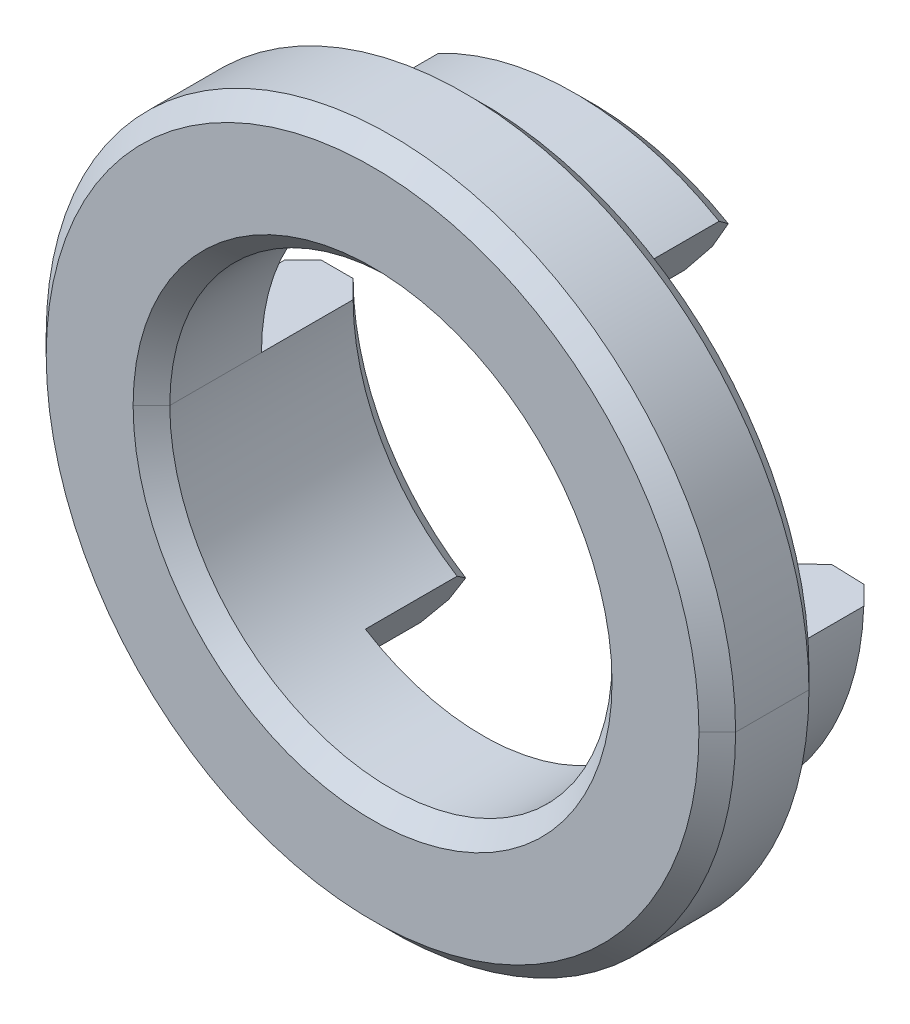
ISO-10303-21;
HEADER;
FILE_DESCRIPTION(('STEP AP214'),'2;1');
FILE_NAME('part.step','',(''),(''),'','','');
FILE_SCHEMA(('AUTOMOTIVE_DESIGN { 1 0 10303 214 1 1 1 1 }'));
ENDSEC;
DATA;
#1=APPLICATION_CONTEXT('core data for automotive mechanical design processes');
#2=APPLICATION_PROTOCOL_DEFINITION('international standard','automotive_design',2000,#1);
#3=PRODUCT_CONTEXT('',#1,'mechanical');
#4=PRODUCT('Part','Part','',(#3));
#5=PRODUCT_RELATED_PRODUCT_CATEGORY('part','',(#4));
#6=PRODUCT_DEFINITION_FORMATION('','',#4);
#7=PRODUCT_DEFINITION_CONTEXT('part definition',#1,'design');
#8=PRODUCT_DEFINITION('design','',#6,#7);
#9=PRODUCT_DEFINITION_SHAPE('','',#8);
#10=(LENGTH_UNIT() NAMED_UNIT(*) SI_UNIT(.MILLI.,.METRE.));
#11=(NAMED_UNIT(*) PLANE_ANGLE_UNIT() SI_UNIT($,.RADIAN.));
#12=(NAMED_UNIT(*) SI_UNIT($,.STERADIAN.) SOLID_ANGLE_UNIT());
#13=UNCERTAINTY_MEASURE_WITH_UNIT(LENGTH_MEASURE(1.E-05),#10,'distance_accuracy_value','');
#14=(GEOMETRIC_REPRESENTATION_CONTEXT(3) GLOBAL_UNCERTAINTY_ASSIGNED_CONTEXT((#13)) GLOBAL_UNIT_ASSIGNED_CONTEXT((#10,
#11,#12)) REPRESENTATION_CONTEXT('',''));
#15=CARTESIAN_POINT('',(0.,0.,0.));
#16=DIRECTION('',(0.,0.,1.));
#17=DIRECTION('',(1.,0.,0.));
#18=AXIS2_PLACEMENT_3D('',#15,#16,#17);
#19=CARTESIAN_POINT('',(0.,0.,1.25));
#20=DIRECTION('',(0.,0.,1.));
#21=DIRECTION('',(1.,0.,0.));
#22=AXIS2_PLACEMENT_3D('',#19,#20,#21);
#23=CONICAL_SURFACE('',#22,3.015,0.785398163397448);
#24=CARTESIAN_POINT('',(0.,0.,1.25));
#25=DIRECTION('',(0.,0.,1.));
#26=DIRECTION('',(1.,0.,0.));
#27=AXIS2_PLACEMENT_3D('',#24,#25,#26);
#28=CIRCLE('',#27,3.015);
#29=CARTESIAN_POINT('',(-3.015,0.,1.25));
#30=VERTEX_POINT('',#29);
#31=CARTESIAN_POINT('',(3.015,0.,1.25));
#32=VERTEX_POINT('',#31);
#33=EDGE_CURVE('E41',#30,#32,#28,.T.);
#34=ORIENTED_EDGE('',*,*,#33,.F.);
#35=DIRECTION('',(-0.707106781186548,0.,0.707106781186548));
#36=VECTOR('',#35,1.);
#37=CARTESIAN_POINT('',(-3.015,0.,1.25));
#38=LINE('',#37,#36);
#39=CARTESIAN_POINT('',(-3.265,0.,1.5));
#40=VERTEX_POINT('',#39);
#41=EDGE_CURVE('E10',#30,#40,#38,.T.);
#42=ORIENTED_EDGE('',*,*,#41,.T.);
#43=CARTESIAN_POINT('',(0.,0.,1.5));
#44=DIRECTION('',(0.,0.,-1.));
#45=DIRECTION('',(1.,0.,0.));
#46=AXIS2_PLACEMENT_3D('',#43,#44,#45);
#47=CIRCLE('',#46,3.265);
#48=CARTESIAN_POINT('',(3.265,0.,1.5));
#49=VERTEX_POINT('',#48);
#50=EDGE_CURVE('E512',#49,#40,#47,.T.);
#51=ORIENTED_EDGE('',*,*,#50,.F.);
#52=DIRECTION('',(0.707106781186548,0.,0.707106781186548));
#53=VECTOR('',#52,1.);
#54=CARTESIAN_POINT('',(3.015,0.,1.25));
#55=LINE('',#54,#53);
#56=EDGE_CURVE('E292',#32,#49,#55,.T.);
#57=ORIENTED_EDGE('',*,*,#56,.F.);
#58=EDGE_LOOP('',(#34,#42,#51,#57));
#59=FACE_BOUND('',#58,.T.);
#60=ADVANCED_FACE('F16',(#59),#23,.F.);
#61=CARTESIAN_POINT('',(0.,0.,1.5));
#62=DIRECTION('',(0.,0.,-1.));
#63=DIRECTION('',(-1.,0.,0.));
#64=AXIS2_PLACEMENT_3D('',#61,#62,#63);
#65=CONICAL_SURFACE('',#64,4.45,0.785398163397443);
#66=CARTESIAN_POINT('',(0.,0.,1.5));
#67=DIRECTION('',(0.,0.,1.));
#68=DIRECTION('',(1.,0.,0.));
#69=AXIS2_PLACEMENT_3D('',#66,#67,#68);
#70=CIRCLE('',#69,4.45);
#71=CARTESIAN_POINT('',(4.45,0.,1.5));
#72=VERTEX_POINT('',#71);
#73=CARTESIAN_POINT('',(-4.45,0.,1.5));
#74=VERTEX_POINT('',#73);
#75=EDGE_CURVE('E408',#72,#74,#70,.T.);
#76=ORIENTED_EDGE('',*,*,#75,.F.);
#77=DIRECTION('',(0.707106781186544,0.,-0.707106781186551));
#78=VECTOR('',#77,1.);
#79=CARTESIAN_POINT('',(4.45,0.,1.5));
#80=LINE('',#79,#78);
#81=CARTESIAN_POINT('',(4.7,0.,1.25));
#82=VERTEX_POINT('',#81);
#83=EDGE_CURVE('E27',#72,#82,#80,.T.);
#84=ORIENTED_EDGE('',*,*,#83,.T.);
#85=CARTESIAN_POINT('',(0.,0.,1.25));
#86=DIRECTION('',(0.,0.,-1.));
#87=DIRECTION('',(1.,0.,0.));
#88=AXIS2_PLACEMENT_3D('',#85,#86,#87);
#89=CIRCLE('',#88,4.7);
#90=CARTESIAN_POINT('',(-4.7,0.,1.25));
#91=VERTEX_POINT('',#90);
#92=EDGE_CURVE('E318',#91,#82,#89,.T.);
#93=ORIENTED_EDGE('',*,*,#92,.F.);
#94=DIRECTION('',(-0.707106781186544,0.,-0.707106781186551));
#95=VECTOR('',#94,1.);
#96=CARTESIAN_POINT('',(-4.45,0.,1.5));
#97=LINE('',#96,#95);
#98=EDGE_CURVE('E358',#74,#91,#97,.T.);
#99=ORIENTED_EDGE('',*,*,#98,.F.);
#100=EDGE_LOOP('',(#76,#84,#93,#99));
#101=FACE_BOUND('',#100,.T.);
#102=ADVANCED_FACE('F601',(#101),#65,.T.);
#103=CARTESIAN_POINT('',(0.,0.,0.25));
#104=DIRECTION('',(0.,0.,1.));
#105=DIRECTION('',(1.,0.,0.));
#106=AXIS2_PLACEMENT_3D('',#103,#104,#105);
#107=CONICAL_SURFACE('',#106,4.7,0.785398163397452);
#108=CARTESIAN_POINT('',(0.,0.,0.));
#109=DIRECTION('',(0.,0.,-1.));
#110=DIRECTION('',(1.,0.,0.));
#111=AXIS2_PLACEMENT_3D('',#108,#109,#110);
#112=CIRCLE('',#111,4.45);
#113=CARTESIAN_POINT('',(-4.45,0.,0.));
#114=VERTEX_POINT('',#113);
#115=CARTESIAN_POINT('',(4.45,0.,0.));
#116=VERTEX_POINT('',#115);
#117=EDGE_CURVE('E287',#114,#116,#112,.T.);
#118=ORIENTED_EDGE('',*,*,#117,.F.);
#119=DIRECTION('',(-0.70710678118655,0.,0.707106781186545));
#120=VECTOR('',#119,1.);
#121=CARTESIAN_POINT('',(-4.7,0.,0.25));
#122=LINE('',#121,#120);
#123=CARTESIAN_POINT('',(-4.7,0.,0.25));
#124=VERTEX_POINT('',#123);
#125=EDGE_CURVE('E335',#114,#124,#122,.T.);
#126=ORIENTED_EDGE('',*,*,#125,.T.);
#127=CARTESIAN_POINT('',(0.,0.,0.25));
#128=DIRECTION('',(0.,0.,1.));
#129=DIRECTION('',(1.,0.,0.));
#130=AXIS2_PLACEMENT_3D('',#127,#128,#129);
#131=CIRCLE('',#130,4.7);
#132=CARTESIAN_POINT('',(4.7,0.,0.25));
#133=VERTEX_POINT('',#132);
#134=EDGE_CURVE('E313',#133,#124,#131,.T.);
#135=ORIENTED_EDGE('',*,*,#134,.F.);
#136=DIRECTION('',(0.70710678118655,0.,0.707106781186545));
#137=VECTOR('',#136,1.);
#138=CARTESIAN_POINT('',(4.7,0.,0.25));
#139=LINE('',#138,#137);
#140=EDGE_CURVE('E355',#116,#133,#139,.T.);
#141=ORIENTED_EDGE('',*,*,#140,.F.);
#142=EDGE_LOOP('',(#118,#126,#135,#141));
#143=FACE_BOUND('',#142,.T.);
#144=ADVANCED_FACE('F607',(#143),#107,.T.);
#145=CARTESIAN_POINT('',(0.,0.,-1.5));
#146=DIRECTION('',(0.,0.,1.));
#147=DIRECTION('',(1.,0.,0.));
#148=AXIS2_PLACEMENT_3D('',#145,#146,#147);
#149=CYLINDRICAL_SURFACE('',#148,3.015);
#150=DIRECTION('',(0.,0.,1.));
#151=VECTOR('',#150,1.);
#152=CARTESIAN_POINT('',(-3.015,0.,-1.5));
#153=LINE('',#152,#151);
#154=CARTESIAN_POINT('',(-3.015,0.,-1.25));
#155=VERTEX_POINT('',#154);
#156=CARTESIAN_POINT('',(-3.015,0.,0.));
#157=VERTEX_POINT('',#156);
#158=EDGE_CURVE('E372',#155,#157,#153,.T.);
#159=ORIENTED_EDGE('',*,*,#158,.T.);
#160=DIRECTION('',(0.,0.,1.));
#161=VECTOR('',#160,1.);
#162=CARTESIAN_POINT('',(-3.015,0.,-1.5));
#163=LINE('',#162,#161);
#164=EDGE_CURVE('E366',#157,#30,#163,.T.);
#165=ORIENTED_EDGE('',*,*,#164,.T.);
#166=ORIENTED_EDGE('',*,*,#33,.T.);
#167=DIRECTION('',(0.,0.,1.));
#168=VECTOR('',#167,1.);
#169=CARTESIAN_POINT('',(3.015,0.,-1.5));
#170=LINE('',#169,#168);
#171=CARTESIAN_POINT('',(3.015,0.,0.));
#172=VERTEX_POINT('',#171);
#173=EDGE_CURVE('E212',#172,#32,#170,.T.);
#174=ORIENTED_EDGE('',*,*,#173,.F.);
#175=CARTESIAN_POINT('',(0.,0.,0.));
#176=DIRECTION('',(0.,0.,-1.));
#177=DIRECTION('',(1.,0.,0.));
#178=AXIS2_PLACEMENT_3D('',#175,#176,#177);
#179=CIRCLE('',#178,3.015);
#180=CARTESIAN_POINT('',(3.01316334346257,-0.105221982558061,0.));
#181=VERTEX_POINT('',#180);
#182=EDGE_CURVE('E217',#172,#181,#179,.T.);
#183=ORIENTED_EDGE('',*,*,#182,.T.);
#184=DIRECTION('',(0.,0.,-1.));
#185=VECTOR('',#184,1.);
#186=CARTESIAN_POINT('',(3.01316334346257,-0.105221982558061,-1.5));
#187=LINE('',#186,#185);
#188=CARTESIAN_POINT('',(3.01316334346257,-0.105221982558061,-1.25));
#189=VERTEX_POINT('',#188);
#190=EDGE_CURVE('E236',#181,#189,#187,.T.);
#191=ORIENTED_EDGE('',*,*,#190,.T.);
#192=CARTESIAN_POINT('',(0.,0.,-1.25));
#193=DIRECTION('',(0.,0.,-1.));
#194=DIRECTION('',(1.,0.,0.));
#195=AXIS2_PLACEMENT_3D('',#192,#193,#194);
#196=CIRCLE('',#195,3.015);
#197=CARTESIAN_POINT('',(1.50749999999997,-2.61106659241009,-1.25));
#198=VERTEX_POINT('',#197);
#199=EDGE_CURVE('E416',#189,#198,#196,.T.);
#200=ORIENTED_EDGE('',*,*,#199,.T.);
#201=DIRECTION('',(0.,0.,1.));
#202=VECTOR('',#201,1.);
#203=CARTESIAN_POINT('',(1.50749999999997,-2.61106659241009,-1.5));
#204=LINE('',#203,#202);
#205=CARTESIAN_POINT('',(1.50749999999997,-2.6110665924101,0.));
#206=VERTEX_POINT('',#205);
#207=EDGE_CURVE('E298',#198,#206,#204,.T.);
#208=ORIENTED_EDGE('',*,*,#207,.T.);
#209=CARTESIAN_POINT('',(0.,0.,0.));
#210=DIRECTION('',(0.,0.,-1.));
#211=DIRECTION('',(1.,0.,0.));
#212=AXIS2_PLACEMENT_3D('',#209,#210,#211);
#213=CIRCLE('',#212,3.015);
#214=CARTESIAN_POINT('',(-1.59770658166315,-2.55686500991161,0.));
#215=VERTEX_POINT('',#214);
#216=EDGE_CURVE('E294',#206,#215,#213,.T.);
#217=ORIENTED_EDGE('',*,*,#216,.T.);
#218=DIRECTION('',(0.,0.,-1.));
#219=VECTOR('',#218,1.);
#220=CARTESIAN_POINT('',(-1.59770658166315,-2.55686500991161,-1.5));
#221=LINE('',#220,#219);
#222=CARTESIAN_POINT('',(-1.59770658166315,-2.55686500991161,-1.25));
#223=VERTEX_POINT('',#222);
#224=EDGE_CURVE('E299',#215,#223,#221,.T.);
#225=ORIENTED_EDGE('',*,*,#224,.T.);
#226=CARTESIAN_POINT('',(0.,0.,-1.25));
#227=DIRECTION('',(0.,0.,-1.));
#228=DIRECTION('',(1.,0.,0.));
#229=AXIS2_PLACEMENT_3D('',#226,#227,#228);
#230=CIRCLE('',#229,3.015);
#231=EDGE_CURVE('E315',#223,#155,#230,.T.);
#232=ORIENTED_EDGE('',*,*,#231,.T.);
#233=EDGE_LOOP('',(#159,#165,#166,#174,#183,#191,#200,#208,#217,#225,#232));
#234=FACE_BOUND('',#233,.T.);
#235=ADVANCED_FACE('F215',(#234),#149,.F.);
#236=CARTESIAN_POINT('',(0.,0.,1.5));
#237=DIRECTION('',(0.,0.,-1.));
#238=DIRECTION('',(-1.,0.,0.));
#239=AXIS2_PLACEMENT_3D('',#236,#237,#238);
#240=CYLINDRICAL_SURFACE('',#239,4.7);
#241=ORIENTED_EDGE('',*,*,#92,.T.);
#242=DIRECTION('',(0.,0.,-1.));
#243=VECTOR('',#242,1.);
#244=CARTESIAN_POINT('',(4.7,0.,1.5));
#245=LINE('',#244,#243);
#246=EDGE_CURVE('E387',#82,#133,#245,.T.);
#247=ORIENTED_EDGE('',*,*,#246,.T.);
#248=ORIENTED_EDGE('',*,*,#134,.T.);
#249=DIRECTION('',(0.,0.,-1.));
#250=VECTOR('',#249,1.);
#251=CARTESIAN_POINT('',(-4.7,0.,1.5));
#252=LINE('',#251,#250);
#253=EDGE_CURVE('E389',#91,#124,#252,.T.);
#254=ORIENTED_EDGE('',*,*,#253,.F.);
#255=EDGE_LOOP('',(#241,#247,#248,#254));
#256=FACE_BOUND('',#255,.T.);
#257=ADVANCED_FACE('F612',(#256),#240,.T.);
#258=CARTESIAN_POINT('',(0.,0.,-1.5));
#259=DIRECTION('',(0.,0.,1.));
#260=DIRECTION('',(1.,0.,0.));
#261=AXIS2_PLACEMENT_3D('',#258,#259,#260);
#262=CYLINDRICAL_SURFACE('',#261,3.95);
#263=DIRECTION('',(0.,0.,-1.));
#264=VECTOR('',#263,1.);
#265=CARTESIAN_POINT('',(1.97499999999997,-3.42080034494855,5.67032604100596));
#266=LINE('',#265,#264);
#267=CARTESIAN_POINT('',(1.97499999999997,-3.42080034494855,0.));
#268=VERTEX_POINT('',#267);
#269=CARTESIAN_POINT('',(1.97499999999997,-3.42080034494855,-1.25));
#270=VERTEX_POINT('',#269);
#271=EDGE_CURVE('E309',#268,#270,#266,.T.);
#272=ORIENTED_EDGE('',*,*,#271,.T.);
#273=CARTESIAN_POINT('',(0.,0.,-1.25));
#274=DIRECTION('',(0.,0.,1.));
#275=DIRECTION('',(1.,0.,0.));
#276=AXIS2_PLACEMENT_3D('',#273,#274,#275);
#277=CIRCLE('',#276,3.95);
#278=CARTESIAN_POINT('',(3.94759376672544,-0.137853011974906,-1.25));
#279=VERTEX_POINT('',#278);
#280=EDGE_CURVE('E314',#270,#279,#277,.T.);
#281=ORIENTED_EDGE('',*,*,#280,.T.);
#282=DIRECTION('',(0.,0.,-1.));
#283=VECTOR('',#282,1.);
#284=CARTESIAN_POINT('',(3.94759376672543,-0.137853011974906,5.31662615901686));
#285=LINE('',#284,#283);
#286=CARTESIAN_POINT('',(3.94759376672543,-0.137853011974906,0.));
#287=VERTEX_POINT('',#286);
#288=EDGE_CURVE('E373',#287,#279,#285,.T.);
#289=ORIENTED_EDGE('',*,*,#288,.F.);
#290=CARTESIAN_POINT('',(0.,0.,0.));
#291=DIRECTION('',(0.,0.,1.));
#292=DIRECTION('',(1.,0.,0.));
#293=AXIS2_PLACEMENT_3D('',#290,#291,#292);
#294=CIRCLE('',#293,3.95);
#295=EDGE_CURVE('E331',#268,#287,#294,.T.);
#296=ORIENTED_EDGE('',*,*,#295,.F.);
#297=EDGE_LOOP('',(#272,#281,#289,#296));
#298=FACE_BOUND('',#297,.T.);
#299=ADVANCED_FACE('F565',(#298),#262,.T.);
#300=CARTESIAN_POINT('',(0.,0.,-1.5));
#301=DIRECTION('',(0.,0.,1.));
#302=DIRECTION('',(1.,0.,0.));
#303=AXIS2_PLACEMENT_3D('',#300,#301,#302);
#304=PLANE('',#303);
#305=CARTESIAN_POINT('',(0.,0.,-1.5));
#306=DIRECTION('',(0.,0.,-1.));
#307=DIRECTION('',(1.,0.,0.));
#308=AXIS2_PLACEMENT_3D('',#305,#306,#307);
#309=CIRCLE('',#308,3.7);
#310=CARTESIAN_POINT('',(3.69774605997065,-0.129128137799279,-1.5));
#311=VERTEX_POINT('',#310);
#312=CARTESIAN_POINT('',(1.84999999999997,-3.20429399400245,-1.5));
#313=VERTEX_POINT('',#312);
#314=EDGE_CURVE('E280',#311,#313,#309,.T.);
#315=ORIENTED_EDGE('',*,*,#314,.T.);
#316=DIRECTION('',(0.499999999999992,-0.866025403784443,0.));
#317=VECTOR('',#316,1.);
#318=CARTESIAN_POINT('',(0.,0.,-1.5));
#319=LINE('',#318,#317);
#320=CARTESIAN_POINT('',(1.63249999999998,-2.82757294335621,-1.5));
#321=VERTEX_POINT('',#320);
#322=EDGE_CURVE('E258',#321,#313,#319,.T.);
#323=ORIENTED_EDGE('',*,*,#322,.F.);
#324=CARTESIAN_POINT('',(0.,0.,-1.5));
#325=DIRECTION('',(0.,0.,1.));
#326=DIRECTION('',(1.,0.,0.));
#327=AXIS2_PLACEMENT_3D('',#324,#325,#326);
#328=CIRCLE('',#327,3.265);
#329=CARTESIAN_POINT('',(3.26301105021734,-0.113946856733688,-1.5));
#330=VERTEX_POINT('',#329);
#331=EDGE_CURVE('E325',#321,#330,#328,.T.);
#332=ORIENTED_EDGE('',*,*,#331,.T.);
#333=DIRECTION('',(-0.999390827019095,0.0348994967025078,0.));
#334=VECTOR('',#333,1.);
#335=CARTESIAN_POINT('',(0.,0.,-1.5));
#336=LINE('',#335,#334);
#337=EDGE_CURVE('E394',#311,#330,#336,.T.);
#338=ORIENTED_EDGE('',*,*,#337,.F.);
#339=EDGE_LOOP('',(#315,#323,#332,#338));
#340=FACE_BOUND('',#339,.T.);
#341=ADVANCED_FACE('F625',(#340),#304,.F.);
#342=CARTESIAN_POINT('',(0.,0.,-1.25));
#343=DIRECTION('',(0.,0.,1.));
#344=DIRECTION('',(1.,0.,0.));
#345=AXIS2_PLACEMENT_3D('',#342,#343,#344);
#346=CONICAL_SURFACE('',#345,3.95,0.785398163397448);
#347=DIRECTION('',(0.353553390593268,-0.612372435695798,0.707106781186548));
#348=VECTOR('',#347,1.);
#349=CARTESIAN_POINT('',(0.,0.,-5.2));
#350=LINE('',#349,#348);
#351=EDGE_CURVE('E377',#313,#270,#350,.T.);
#352=ORIENTED_EDGE('',*,*,#351,.F.);
#353=ORIENTED_EDGE('',*,*,#314,.F.);
#354=DIRECTION('',(-0.706676030840834,0.0246776707783408,-0.707106781186548));
#355=VECTOR('',#354,1.);
#356=CARTESIAN_POINT('',(0.,0.,-5.2));
#357=LINE('',#356,#355);
#358=EDGE_CURVE('E397',#279,#311,#357,.T.);
#359=ORIENTED_EDGE('',*,*,#358,.F.);
#360=ORIENTED_EDGE('',*,*,#280,.F.);
#361=EDGE_LOOP('',(#352,#353,#359,#360));
#362=FACE_BOUND('',#361,.T.);
#363=ADVANCED_FACE('F617',(#362),#346,.T.);
#364=CARTESIAN_POINT('',(0.,0.,-1.5));
#365=DIRECTION('',(0.,0.,-1.));
#366=DIRECTION('',(-1.,0.,0.));
#367=AXIS2_PLACEMENT_3D('',#364,#365,#366);
#368=CONICAL_SURFACE('',#367,3.265,0.785398163397445);
#369=DIRECTION('',(0.353553390593267,-0.612372435695796,-0.70710678118655));
#370=VECTOR('',#369,1.);
#371=CARTESIAN_POINT('',(0.,0.,1.765));
#372=LINE('',#371,#370);
#373=EDGE_CURVE('E267',#198,#321,#372,.T.);
#374=ORIENTED_EDGE('',*,*,#373,.F.);
#375=ORIENTED_EDGE('',*,*,#199,.F.);
#376=DIRECTION('',(-0.706676030840832,0.0246776707783407,0.70710678118655));
#377=VECTOR('',#376,1.);
#378=CARTESIAN_POINT('',(0.,0.,1.765));
#379=LINE('',#378,#377);
#380=EDGE_CURVE('E376',#330,#189,#379,.T.);
#381=ORIENTED_EDGE('',*,*,#380,.F.);
#382=ORIENTED_EDGE('',*,*,#331,.F.);
#383=EDGE_LOOP('',(#374,#375,#381,#382));
#384=FACE_BOUND('',#383,.T.);
#385=ADVANCED_FACE('F614',(#384),#368,.F.);
#386=CARTESIAN_POINT('',(0.,0.,-1.5));
#387=DIRECTION('',(0.,0.,1.));
#388=DIRECTION('',(1.,0.,0.));
#389=AXIS2_PLACEMENT_3D('',#386,#387,#388);
#390=CYLINDRICAL_SURFACE('',#389,3.95);
#391=DIRECTION('',(0.,0.,-1.));
#392=VECTOR('',#391,1.);
#393=CARTESIAN_POINT('',(1.975,3.42080034494853,5.31662615901686));
#394=LINE('',#393,#392);
#395=CARTESIAN_POINT('',(1.975,3.42080034494853,0.));
#396=VERTEX_POINT('',#395);
#397=CARTESIAN_POINT('',(1.975,3.42080034494853,-1.25));
#398=VERTEX_POINT('',#397);
#399=EDGE_CURVE('E321',#396,#398,#394,.T.);
#400=ORIENTED_EDGE('',*,*,#399,.T.);
#401=CARTESIAN_POINT('',(0.,0.,-1.25));
#402=DIRECTION('',(0.,0.,1.));
#403=DIRECTION('',(1.,0.,0.));
#404=AXIS2_PLACEMENT_3D('',#401,#402,#403);
#405=CIRCLE('',#404,3.95);
#406=CARTESIAN_POINT('',(-1.85441267300426,3.48764299179276,-1.25));
#407=VERTEX_POINT('',#406);
#408=EDGE_CURVE('E326',#398,#407,#405,.T.);
#409=ORIENTED_EDGE('',*,*,#408,.T.);
#410=DIRECTION('',(0.,0.,-1.));
#411=VECTOR('',#410,1.);
#412=CARTESIAN_POINT('',(-1.85441267300426,3.48764299179276,5.2693598888481));
#413=LINE('',#412,#411);
#414=CARTESIAN_POINT('',(-1.85441267300426,3.48764299179276,0.));
#415=VERTEX_POINT('',#414);
#416=EDGE_CURVE('E359',#415,#407,#413,.T.);
#417=ORIENTED_EDGE('',*,*,#416,.F.);
#418=CARTESIAN_POINT('',(0.,0.,0.));
#419=DIRECTION('',(0.,0.,1.));
#420=DIRECTION('',(1.,0.,0.));
#421=AXIS2_PLACEMENT_3D('',#418,#419,#420);
#422=CIRCLE('',#421,3.95);
#423=EDGE_CURVE('E342',#396,#415,#422,.T.);
#424=ORIENTED_EDGE('',*,*,#423,.F.);
#425=EDGE_LOOP('',(#400,#409,#417,#424));
#426=FACE_BOUND('',#425,.T.);
#427=ADVANCED_FACE('F481',(#426),#390,.T.);
#428=CARTESIAN_POINT('',(0.,0.,-1.5));
#429=DIRECTION('',(0.,0.,1.));
#430=DIRECTION('',(1.,0.,0.));
#431=AXIS2_PLACEMENT_3D('',#428,#429,#430);
#432=PLANE('',#431);
#433=CARTESIAN_POINT('',(0.,0.,-1.5));
#434=DIRECTION('',(0.,0.,-1.));
#435=DIRECTION('',(1.,0.,0.));
#436=AXIS2_PLACEMENT_3D('',#433,#434,#435);
#437=CIRCLE('',#436,3.7);
#438=CARTESIAN_POINT('',(-1.73704478230779,3.26690609357804,-1.5));
#439=VERTEX_POINT('',#438);
#440=CARTESIAN_POINT('',(1.85,3.20429399400241,-1.5));
#441=VERTEX_POINT('',#440);
#442=EDGE_CURVE('E353',#439,#441,#437,.T.);
#443=ORIENTED_EDGE('',*,*,#442,.T.);
#444=DIRECTION('',(0.5,0.866025403784436,0.));
#445=VECTOR('',#444,1.);
#446=CARTESIAN_POINT('',(0.,0.,-1.5));
#447=LINE('',#446,#445);
#448=CARTESIAN_POINT('',(1.6325,2.82757294335619,-1.5));
#449=VERTEX_POINT('',#448);
#450=EDGE_CURVE('E460',#449,#441,#447,.T.);
#451=ORIENTED_EDGE('',*,*,#450,.F.);
#452=CARTESIAN_POINT('',(0.,0.,-1.5));
#453=DIRECTION('',(0.,0.,1.));
#454=DIRECTION('',(1.,0.,0.));
#455=AXIS2_PLACEMENT_3D('',#452,#453,#454);
#456=CIRCLE('',#455,3.265);
#457=CARTESIAN_POINT('',(-1.53282465249592,2.8828238906844,-1.5));
#458=VERTEX_POINT('',#457);
#459=EDGE_CURVE('E349',#449,#458,#456,.T.);
#460=ORIENTED_EDGE('',*,*,#459,.T.);
#461=DIRECTION('',(0.469471562785889,-0.882947592858928,0.));
#462=VECTOR('',#461,1.);
#463=CARTESIAN_POINT('',(0.,0.,-1.5));
#464=LINE('',#463,#462);
#465=EDGE_CURVE('E20',#439,#458,#464,.T.);
#466=ORIENTED_EDGE('',*,*,#465,.F.);
#467=EDGE_LOOP('',(#443,#451,#460,#466));
#468=FACE_BOUND('',#467,.T.);
#469=ADVANCED_FACE('F499',(#468),#432,.F.);
#470=CARTESIAN_POINT('',(0.,0.,-1.25));
#471=DIRECTION('',(0.,0.,1.));
#472=DIRECTION('',(1.,0.,0.));
#473=AXIS2_PLACEMENT_3D('',#470,#471,#472);
#474=CONICAL_SURFACE('',#473,3.95,0.785398163397448);
#475=DIRECTION('',(0.353553390593277,0.612372435695793,0.707106781186548));
#476=VECTOR('',#475,1.);
#477=CARTESIAN_POINT('',(0.,0.,-5.2));
#478=LINE('',#477,#476);
#479=EDGE_CURVE('E363',#441,#398,#478,.T.);
#480=ORIENTED_EDGE('',*,*,#479,.F.);
#481=ORIENTED_EDGE('',*,*,#442,.F.);
#482=DIRECTION('',(0.331966525620148,-0.624338230342887,-0.707106781186548));
#483=VECTOR('',#482,1.);
#484=CARTESIAN_POINT('',(0.,0.,-5.2));
#485=LINE('',#484,#483);
#486=EDGE_CURVE('E300',#407,#439,#485,.T.);
#487=ORIENTED_EDGE('',*,*,#486,.F.);
#488=ORIENTED_EDGE('',*,*,#408,.F.);
#489=EDGE_LOOP('',(#480,#481,#487,#488));
#490=FACE_BOUND('',#489,.T.);
#491=ADVANCED_FACE('F486',(#490),#474,.T.);
#492=CARTESIAN_POINT('',(0.,0.,-1.5));
#493=DIRECTION('',(0.,0.,-1.));
#494=DIRECTION('',(-1.,0.,0.));
#495=AXIS2_PLACEMENT_3D('',#492,#493,#494);
#496=CONICAL_SURFACE('',#495,3.265,0.785398163397445);
#497=DIRECTION('',(0.353553390593276,0.612372435695791,-0.70710678118655));
#498=VECTOR('',#497,1.);
#499=CARTESIAN_POINT('',(0.,0.,1.765));
#500=LINE('',#499,#498);
#501=CARTESIAN_POINT('',(1.5075,2.61106659241007,-1.25));
#502=VERTEX_POINT('',#501);
#503=EDGE_CURVE('E456',#502,#449,#500,.T.);
#504=ORIENTED_EDGE('',*,*,#503,.F.);
#505=CARTESIAN_POINT('',(0.,0.,-1.25));
#506=DIRECTION('',(0.,0.,-1.));
#507=DIRECTION('',(1.,0.,0.));
#508=AXIS2_PLACEMENT_3D('',#505,#506,#507);
#509=CIRCLE('',#508,3.015);
#510=CARTESIAN_POINT('',(-1.41545676179945,2.66208699246967,-1.25));
#511=VERTEX_POINT('',#510);
#512=EDGE_CURVE('E250',#511,#502,#509,.T.);
#513=ORIENTED_EDGE('',*,*,#512,.F.);
#514=DIRECTION('',(0.331966525620147,-0.624338230342885,0.70710678118655));
#515=VECTOR('',#514,1.);
#516=CARTESIAN_POINT('',(0.,0.,1.765));
#517=LINE('',#516,#515);
#518=EDGE_CURVE('E362',#458,#511,#517,.T.);
#519=ORIENTED_EDGE('',*,*,#518,.F.);
#520=ORIENTED_EDGE('',*,*,#459,.F.);
#521=EDGE_LOOP('',(#504,#513,#519,#520));
#522=FACE_BOUND('',#521,.T.);
#523=ADVANCED_FACE('F649',(#522),#496,.F.);
#524=CARTESIAN_POINT('',(0.,0.,-1.5));
#525=DIRECTION('',(0.,0.,1.));
#526=DIRECTION('',(1.,0.,0.));
#527=AXIS2_PLACEMENT_3D('',#524,#525,#526);
#528=CYLINDRICAL_SURFACE('',#527,3.95);
#529=DIRECTION('',(0.,0.,-1.));
#530=VECTOR('',#529,1.);
#531=CARTESIAN_POINT('',(-2.0931810937212,-3.34978997981786,5.67032604100596));
#532=LINE('',#531,#530);
#533=CARTESIAN_POINT('',(-2.0931810937212,-3.34978997981786,0.));
#534=VERTEX_POINT('',#533);
#535=CARTESIAN_POINT('',(-2.0931810937212,-3.34978997981786,-1.25));
#536=VERTEX_POINT('',#535);
#537=EDGE_CURVE('E276',#534,#536,#532,.T.);
#538=ORIENTED_EDGE('',*,*,#537,.F.);
#539=CARTESIAN_POINT('',(0.,0.,0.));
#540=DIRECTION('',(0.,0.,1.));
#541=DIRECTION('',(1.,0.,0.));
#542=AXIS2_PLACEMENT_3D('',#539,#540,#541);
#543=CIRCLE('',#542,3.95);
#544=CARTESIAN_POINT('',(-3.95,0.,0.));
#545=VERTEX_POINT('',#544);
#546=EDGE_CURVE('E305',#545,#534,#543,.T.);
#547=ORIENTED_EDGE('',*,*,#546,.F.);
#548=DIRECTION('',(0.,0.,-1.));
#549=VECTOR('',#548,1.);
#550=CARTESIAN_POINT('',(-3.95,0.,5.2693598888481));
#551=LINE('',#550,#549);
#552=CARTESIAN_POINT('',(-3.95,0.,-1.25));
#553=VERTEX_POINT('',#552);
#554=EDGE_CURVE('E354',#545,#553,#551,.T.);
#555=ORIENTED_EDGE('',*,*,#554,.T.);
#556=CARTESIAN_POINT('',(0.,0.,-1.25));
#557=DIRECTION('',(0.,0.,1.));
#558=DIRECTION('',(1.,0.,0.));
#559=AXIS2_PLACEMENT_3D('',#556,#557,#558);
#560=CIRCLE('',#559,3.95);
#561=EDGE_CURVE('E253',#553,#536,#560,.T.);
#562=ORIENTED_EDGE('',*,*,#561,.T.);
#563=EDGE_LOOP('',(#538,#547,#555,#562));
#564=FACE_BOUND('',#563,.T.);
#565=ADVANCED_FACE('F552',(#564),#528,.T.);
#566=CARTESIAN_POINT('',(0.,0.,-1.5));
#567=DIRECTION('',(0.,0.,1.));
#568=DIRECTION('',(1.,0.,0.));
#569=AXIS2_PLACEMENT_3D('',#566,#567,#568);
#570=PLANE('',#569);
#571=CARTESIAN_POINT('',(0.,0.,-1.5));
#572=DIRECTION('',(0.,0.,1.));
#573=DIRECTION('',(1.,0.,0.));
#574=AXIS2_PLACEMENT_3D('',#571,#572,#573);
#575=CIRCLE('',#574,3.265);
#576=CARTESIAN_POINT('',(-3.265,0.,-1.5));
#577=VERTEX_POINT('',#576);
#578=CARTESIAN_POINT('',(-1.73018639772145,-2.76887703395071,-1.5));
#579=VERTEX_POINT('',#578);
#580=EDGE_CURVE('E424',#577,#579,#575,.T.);
#581=ORIENTED_EDGE('',*,*,#580,.T.);
#582=DIRECTION('',(0.529919264233215,0.84804809615642,0.));
#583=VECTOR('',#582,1.);
#584=CARTESIAN_POINT('',(0.,0.,-1.5));
#585=LINE('',#584,#583);
#586=CARTESIAN_POINT('',(-1.96070127766289,-3.13777795577876,-1.5));
#587=VERTEX_POINT('',#586);
#588=EDGE_CURVE('E259',#587,#579,#585,.T.);
#589=ORIENTED_EDGE('',*,*,#588,.F.);
#590=CARTESIAN_POINT('',(0.,0.,-1.5));
#591=DIRECTION('',(0.,0.,-1.));
#592=DIRECTION('',(1.,0.,0.));
#593=AXIS2_PLACEMENT_3D('',#590,#591,#592);
#594=CIRCLE('',#593,3.7);
#595=CARTESIAN_POINT('',(-3.7,0.,-1.5));
#596=VERTEX_POINT('',#595);
#597=EDGE_CURVE('E420',#587,#596,#594,.T.);
#598=ORIENTED_EDGE('',*,*,#597,.T.);
#599=DIRECTION('',(-1.,0.,0.));
#600=VECTOR('',#599,1.);
#601=CARTESIAN_POINT('',(0.,0.,-1.5));
#602=LINE('',#601,#600);
#603=EDGE_CURVE('E304',#577,#596,#602,.T.);
#604=ORIENTED_EDGE('',*,*,#603,.F.);
#605=EDGE_LOOP('',(#581,#589,#598,#604));
#606=FACE_BOUND('',#605,.T.);
#607=ADVANCED_FACE('F544',(#606),#570,.F.);
#608=CARTESIAN_POINT('',(0.,0.,1.5));
#609=DIRECTION('',(0.,0.,-1.));
#610=DIRECTION('',(-1.,0.,0.));
#611=AXIS2_PLACEMENT_3D('',#608,#609,#610);
#612=CYLINDRICAL_SURFACE('',#611,4.7);
#613=ORIENTED_EDGE('',*,*,#246,.F.);
#614=CARTESIAN_POINT('',(0.,0.,1.25));
#615=DIRECTION('',(0.,0.,-1.));
#616=DIRECTION('',(1.,0.,0.));
#617=AXIS2_PLACEMENT_3D('',#614,#615,#616);
#618=CIRCLE('',#617,4.7);
#619=EDGE_CURVE('E392',#82,#91,#618,.T.);
#620=ORIENTED_EDGE('',*,*,#619,.T.);
#621=ORIENTED_EDGE('',*,*,#253,.T.);
#622=CARTESIAN_POINT('',(0.,0.,0.25));
#623=DIRECTION('',(0.,0.,1.));
#624=DIRECTION('',(1.,0.,0.));
#625=AXIS2_PLACEMENT_3D('',#622,#623,#624);
#626=CIRCLE('',#625,4.7);
#627=EDGE_CURVE('E393',#124,#133,#626,.T.);
#628=ORIENTED_EDGE('',*,*,#627,.T.);
#629=EDGE_LOOP('',(#613,#620,#621,#628));
#630=FACE_BOUND('',#629,.T.);
#631=ADVANCED_FACE('F626',(#630),#612,.T.);
#632=CARTESIAN_POINT('',(0.,0.,1.5));
#633=DIRECTION('',(0.,0.,1.));
#634=DIRECTION('',(1.,0.,0.));
#635=AXIS2_PLACEMENT_3D('',#632,#633,#634);
#636=PLANE('',#635);
#637=CARTESIAN_POINT('',(0.,0.,1.5));
#638=DIRECTION('',(0.,0.,1.));
#639=DIRECTION('',(1.,0.,0.));
#640=AXIS2_PLACEMENT_3D('',#637,#638,#639);
#641=CIRCLE('',#640,4.45);
#642=EDGE_CURVE('E404',#74,#72,#641,.T.);
#643=ORIENTED_EDGE('',*,*,#642,.T.);
#644=ORIENTED_EDGE('',*,*,#75,.T.);
#645=EDGE_LOOP('',(#643,#644));
#646=FACE_BOUND('',#645,.T.);
#647=ORIENTED_EDGE('',*,*,#50,.T.);
#648=CARTESIAN_POINT('',(0.,0.,1.5));
#649=DIRECTION('',(0.,0.,-1.));
#650=DIRECTION('',(1.,0.,0.));
#651=AXIS2_PLACEMENT_3D('',#648,#649,#650);
#652=CIRCLE('',#651,3.265);
#653=EDGE_CURVE('E286',#40,#49,#652,.T.);
#654=ORIENTED_EDGE('',*,*,#653,.T.);
#655=EDGE_LOOP('',(#647,#654));
#656=FACE_BOUND('',#655,.T.);
#657=ADVANCED_FACE('F629',(#646,#656),#636,.T.);
#658=CARTESIAN_POINT('',(0.,0.,0.));
#659=DIRECTION('',(0.,0.,1.));
#660=DIRECTION('',(1.,0.,0.));
#661=AXIS2_PLACEMENT_3D('',#658,#659,#660);
#662=PLANE('',#661);
#663=CARTESIAN_POINT('',(0.,0.,0.));
#664=DIRECTION('',(0.,0.,-1.));
#665=DIRECTION('',(1.,0.,0.));
#666=AXIS2_PLACEMENT_3D('',#663,#664,#665);
#667=CIRCLE('',#666,4.45);
#668=EDGE_CURVE('E282',#116,#114,#667,.T.);
#669=ORIENTED_EDGE('',*,*,#668,.T.);
#670=ORIENTED_EDGE('',*,*,#117,.T.);
#671=EDGE_LOOP('',(#669,#670));
#672=FACE_BOUND('',#671,.T.);
#673=ORIENTED_EDGE('',*,*,#546,.T.);
#674=DIRECTION('',(0.529919264233215,0.84804809615642,0.));
#675=VECTOR('',#674,1.);
#676=CARTESIAN_POINT('',(0.,0.,0.));
#677=LINE('',#676,#675);
#678=EDGE_CURVE('E308',#534,#215,#677,.T.);
#679=ORIENTED_EDGE('',*,*,#678,.T.);
#680=ORIENTED_EDGE('',*,*,#216,.F.);
#681=DIRECTION('',(0.499999999999992,-0.866025403784443,0.));
#682=VECTOR('',#681,1.);
#683=CARTESIAN_POINT('',(0.,0.,0.));
#684=LINE('',#683,#682);
#685=EDGE_CURVE('E327',#206,#268,#684,.T.);
#686=ORIENTED_EDGE('',*,*,#685,.T.);
#687=ORIENTED_EDGE('',*,*,#295,.T.);
#688=DIRECTION('',(-0.999390827019095,0.0348994967025078,0.));
#689=VECTOR('',#688,1.);
#690=CARTESIAN_POINT('',(0.,0.,0.));
#691=LINE('',#690,#689);
#692=EDGE_CURVE('E234',#287,#181,#691,.T.);
#693=ORIENTED_EDGE('',*,*,#692,.T.);
#694=ORIENTED_EDGE('',*,*,#182,.F.);
#695=CARTESIAN_POINT('',(0.,0.,0.));
#696=DIRECTION('',(0.,0.,-1.));
#697=DIRECTION('',(1.,0.,0.));
#698=AXIS2_PLACEMENT_3D('',#695,#696,#697);
#699=CIRCLE('',#698,3.015);
#700=CARTESIAN_POINT('',(1.5075,2.61106659241007,0.));
#701=VERTEX_POINT('',#700);
#702=EDGE_CURVE('E224',#701,#172,#699,.T.);
#703=ORIENTED_EDGE('',*,*,#702,.F.);
#704=DIRECTION('',(0.5,0.866025403784436,0.));
#705=VECTOR('',#704,1.);
#706=CARTESIAN_POINT('',(0.,0.,0.));
#707=LINE('',#706,#705);
#708=EDGE_CURVE('E339',#701,#396,#707,.T.);
#709=ORIENTED_EDGE('',*,*,#708,.T.);
#710=ORIENTED_EDGE('',*,*,#423,.T.);
#711=DIRECTION('',(0.469471562785889,-0.882947592858928,0.));
#712=VECTOR('',#711,1.);
#713=CARTESIAN_POINT('',(0.,0.,0.));
#714=LINE('',#713,#712);
#715=CARTESIAN_POINT('',(-1.41545676179945,2.66208699246967,0.));
#716=VERTEX_POINT('',#715);
#717=EDGE_CURVE('E346',#415,#716,#714,.T.);
#718=ORIENTED_EDGE('',*,*,#717,.T.);
#719=CARTESIAN_POINT('',(0.,0.,0.));
#720=DIRECTION('',(0.,0.,-1.));
#721=DIRECTION('',(1.,0.,0.));
#722=AXIS2_PLACEMENT_3D('',#719,#720,#721);
#723=CIRCLE('',#722,3.015);
#724=EDGE_CURVE('E347',#157,#716,#723,.T.);
#725=ORIENTED_EDGE('',*,*,#724,.F.);
#726=DIRECTION('',(-1.,0.,0.));
#727=VECTOR('',#726,1.);
#728=CARTESIAN_POINT('',(0.,0.,0.));
#729=LINE('',#728,#727);
#730=EDGE_CURVE('E343',#157,#545,#729,.T.);
#731=ORIENTED_EDGE('',*,*,#730,.T.);
#732=EDGE_LOOP('',(#673,#679,#680,#686,#687,#693,#694,#703,#709,#710,#718,#725,#731));
#733=FACE_BOUND('',#732,.T.);
#734=ADVANCED_FACE('F229',(#672,#733),#662,.F.);
#735=CARTESIAN_POINT('',(0.,0.,-1.5));
#736=DIRECTION('',(0.,0.,1.));
#737=DIRECTION('',(1.,0.,0.));
#738=AXIS2_PLACEMENT_3D('',#735,#736,#737);
#739=CYLINDRICAL_SURFACE('',#738,3.015);
#740=ORIENTED_EDGE('',*,*,#164,.F.);
#741=ORIENTED_EDGE('',*,*,#724,.T.);
#742=DIRECTION('',(0.,0.,-1.));
#743=VECTOR('',#742,1.);
#744=CARTESIAN_POINT('',(-1.41545676179945,2.66208699246967,-1.5));
#745=LINE('',#744,#743);
#746=EDGE_CURVE('E463',#716,#511,#745,.T.);
#747=ORIENTED_EDGE('',*,*,#746,.T.);
#748=ORIENTED_EDGE('',*,*,#512,.T.);
#749=DIRECTION('',(0.,0.,1.));
#750=VECTOR('',#749,1.);
#751=CARTESIAN_POINT('',(1.5075,2.61106659241007,-1.5));
#752=LINE('',#751,#750);
#753=EDGE_CURVE('E243',#502,#701,#752,.T.);
#754=ORIENTED_EDGE('',*,*,#753,.T.);
#755=ORIENTED_EDGE('',*,*,#702,.T.);
#756=ORIENTED_EDGE('',*,*,#173,.T.);
#757=CARTESIAN_POINT('',(0.,0.,1.25));
#758=DIRECTION('',(0.,0.,1.));
#759=DIRECTION('',(1.,0.,0.));
#760=AXIS2_PLACEMENT_3D('',#757,#758,#759);
#761=CIRCLE('',#760,3.015);
#762=EDGE_CURVE('E225',#32,#30,#761,.T.);
#763=ORIENTED_EDGE('',*,*,#762,.T.);
#764=EDGE_LOOP('',(#740,#741,#747,#748,#754,#755,#756,#763));
#765=FACE_BOUND('',#764,.T.);
#766=ADVANCED_FACE('F240',(#765),#739,.F.);
#767=CARTESIAN_POINT('',(0.,0.,0.25));
#768=DIRECTION('',(0.,0.,1.));
#769=DIRECTION('',(1.,0.,0.));
#770=AXIS2_PLACEMENT_3D('',#767,#768,#769);
#771=CONICAL_SURFACE('',#770,4.7,0.785398163397452);
#772=ORIENTED_EDGE('',*,*,#125,.F.);
#773=ORIENTED_EDGE('',*,*,#668,.F.);
#774=ORIENTED_EDGE('',*,*,#140,.T.);
#775=ORIENTED_EDGE('',*,*,#627,.F.);
#776=EDGE_LOOP('',(#772,#773,#774,#775));
#777=FACE_BOUND('',#776,.T.);
#778=ADVANCED_FACE('F619',(#777),#771,.T.);
#779=CARTESIAN_POINT('',(0.,0.,1.5));
#780=DIRECTION('',(0.,0.,-1.));
#781=DIRECTION('',(-1.,0.,0.));
#782=AXIS2_PLACEMENT_3D('',#779,#780,#781);
#783=CONICAL_SURFACE('',#782,4.45,0.785398163397443);
#784=ORIENTED_EDGE('',*,*,#83,.F.);
#785=ORIENTED_EDGE('',*,*,#642,.F.);
#786=ORIENTED_EDGE('',*,*,#98,.T.);
#787=ORIENTED_EDGE('',*,*,#619,.F.);
#788=EDGE_LOOP('',(#784,#785,#786,#787));
#789=FACE_BOUND('',#788,.T.);
#790=ADVANCED_FACE('F598',(#789),#783,.T.);
#791=CARTESIAN_POINT('',(0.,0.,-1.25));
#792=DIRECTION('',(0.,0.,1.));
#793=DIRECTION('',(1.,0.,0.));
#794=AXIS2_PLACEMENT_3D('',#791,#792,#793);
#795=CONICAL_SURFACE('',#794,3.95,0.785398163397448);
#796=DIRECTION('',(0.374709505220692,0.599660559564546,-0.707106781186548));
#797=VECTOR('',#796,1.);
#798=CARTESIAN_POINT('',(0.,0.,-5.2));
#799=LINE('',#798,#797);
#800=EDGE_CURVE('E255',#536,#587,#799,.T.);
#801=ORIENTED_EDGE('',*,*,#800,.F.);
#802=ORIENTED_EDGE('',*,*,#561,.F.);
#803=DIRECTION('',(-0.707106781186548,0.,0.707106781186548));
#804=VECTOR('',#803,1.);
#805=CARTESIAN_POINT('',(0.,0.,-5.2));
#806=LINE('',#805,#804);
#807=EDGE_CURVE('E288',#596,#553,#806,.T.);
#808=ORIENTED_EDGE('',*,*,#807,.F.);
#809=ORIENTED_EDGE('',*,*,#597,.F.);
#810=EDGE_LOOP('',(#801,#802,#808,#809));
#811=FACE_BOUND('',#810,.T.);
#812=ADVANCED_FACE('F547',(#811),#795,.T.);
#813=CARTESIAN_POINT('',(0.,0.,-1.5));
#814=DIRECTION('',(0.,0.,-1.));
#815=DIRECTION('',(-1.,0.,0.));
#816=AXIS2_PLACEMENT_3D('',#813,#814,#815);
#817=CONICAL_SURFACE('',#816,3.265,0.785398163397445);
#818=DIRECTION('',(0.374709505220691,0.599660559564544,0.70710678118655));
#819=VECTOR('',#818,1.);
#820=CARTESIAN_POINT('',(0.,0.,1.765));
#821=LINE('',#820,#819);
#822=EDGE_CURVE('E269',#579,#223,#821,.T.);
#823=ORIENTED_EDGE('',*,*,#822,.F.);
#824=ORIENTED_EDGE('',*,*,#580,.F.);
#825=DIRECTION('',(-0.707106781186545,0.,-0.70710678118655));
#826=VECTOR('',#825,1.);
#827=CARTESIAN_POINT('',(0.,0.,1.765));
#828=LINE('',#827,#826);
#829=EDGE_CURVE('E293',#155,#577,#828,.T.);
#830=ORIENTED_EDGE('',*,*,#829,.F.);
#831=ORIENTED_EDGE('',*,*,#231,.F.);
#832=EDGE_LOOP('',(#823,#824,#830,#831));
#833=FACE_BOUND('',#832,.T.);
#834=ADVANCED_FACE('F18',(#833),#817,.F.);
#835=CARTESIAN_POINT('',(0.,0.,1.25));
#836=DIRECTION('',(0.,0.,1.));
#837=DIRECTION('',(1.,0.,0.));
#838=AXIS2_PLACEMENT_3D('',#835,#836,#837);
#839=CONICAL_SURFACE('',#838,3.015,0.785398163397448);
#840=ORIENTED_EDGE('',*,*,#41,.F.);
#841=ORIENTED_EDGE('',*,*,#762,.F.);
#842=ORIENTED_EDGE('',*,*,#56,.T.);
#843=ORIENTED_EDGE('',*,*,#653,.F.);
#844=EDGE_LOOP('',(#840,#841,#842,#843));
#845=FACE_BOUND('',#844,.T.);
#846=ADVANCED_FACE('F588',(#845),#839,.F.);
#847=CARTESIAN_POINT('',(0.,0.,5.2693598888481));
#848=DIRECTION('',(0.,-1.,0.));
#849=DIRECTION('',(0.,0.,-1.));
#850=AXIS2_PLACEMENT_3D('',#847,#848,#849);
#851=PLANE('',#850);
#852=ORIENTED_EDGE('',*,*,#807,.T.);
#853=ORIENTED_EDGE('',*,*,#554,.F.);
#854=ORIENTED_EDGE('',*,*,#730,.F.);
#855=ORIENTED_EDGE('',*,*,#158,.F.);
#856=ORIENTED_EDGE('',*,*,#829,.T.);
#857=ORIENTED_EDGE('',*,*,#603,.T.);
#858=EDGE_LOOP('',(#852,#853,#854,#855,#856,#857));
#859=FACE_BOUND('',#858,.T.);
#860=ADVANCED_FACE('F536',(#859),#851,.F.);
#861=CARTESIAN_POINT('',(0.,0.,5.2693598888481));
#862=DIRECTION('',(0.882947592858928,0.469471562785889,0.));
#863=DIRECTION('',(0.,0.,-1.));
#864=AXIS2_PLACEMENT_3D('',#861,#862,#863);
#865=PLANE('',#864);
#866=ORIENTED_EDGE('',*,*,#486,.T.);
#867=ORIENTED_EDGE('',*,*,#465,.T.);
#868=ORIENTED_EDGE('',*,*,#518,.T.);
#869=ORIENTED_EDGE('',*,*,#746,.F.);
#870=ORIENTED_EDGE('',*,*,#717,.F.);
#871=ORIENTED_EDGE('',*,*,#416,.T.);
#872=EDGE_LOOP('',(#866,#867,#868,#869,#870,#871));
#873=FACE_BOUND('',#872,.T.);
#874=ADVANCED_FACE('F489',(#873),#865,.F.);
#875=CARTESIAN_POINT('',(0.,0.,5.31662615901686));
#876=DIRECTION('',(-0.866025403784436,0.5,0.));
#877=DIRECTION('',(0.,0.,1.));
#878=AXIS2_PLACEMENT_3D('',#875,#876,#877);
#879=PLANE('',#878);
#880=ORIENTED_EDGE('',*,*,#479,.T.);
#881=ORIENTED_EDGE('',*,*,#399,.F.);
#882=ORIENTED_EDGE('',*,*,#708,.F.);
#883=ORIENTED_EDGE('',*,*,#753,.F.);
#884=ORIENTED_EDGE('',*,*,#503,.T.);
#885=ORIENTED_EDGE('',*,*,#450,.T.);
#886=EDGE_LOOP('',(#880,#881,#882,#883,#884,#885));
#887=FACE_BOUND('',#886,.T.);
#888=ADVANCED_FACE('F494',(#887),#879,.F.);
#889=CARTESIAN_POINT('',(0.,0.,5.31662615901686));
#890=DIRECTION('',(-0.0348994967025078,-0.999390827019096,0.));
#891=DIRECTION('',(-0.999390827019096,0.0348994967025078,0.));
#892=AXIS2_PLACEMENT_3D('',#889,#890,#891);
#893=PLANE('',#892);
#894=ORIENTED_EDGE('',*,*,#358,.T.);
#895=ORIENTED_EDGE('',*,*,#337,.T.);
#896=ORIENTED_EDGE('',*,*,#380,.T.);
#897=ORIENTED_EDGE('',*,*,#190,.F.);
#898=ORIENTED_EDGE('',*,*,#692,.F.);
#899=ORIENTED_EDGE('',*,*,#288,.T.);
#900=EDGE_LOOP('',(#894,#895,#896,#897,#898,#899));
#901=FACE_BOUND('',#900,.T.);
#902=ADVANCED_FACE('F646',(#901),#893,.F.);
#903=CARTESIAN_POINT('',(0.,0.,5.67032604100596));
#904=DIRECTION('',(0.866025403784443,0.499999999999992,0.));
#905=DIRECTION('',(0.,0.,-1.));
#906=AXIS2_PLACEMENT_3D('',#903,#904,#905);
#907=PLANE('',#906);
#908=ORIENTED_EDGE('',*,*,#351,.T.);
#909=ORIENTED_EDGE('',*,*,#271,.F.);
#910=ORIENTED_EDGE('',*,*,#685,.F.);
#911=ORIENTED_EDGE('',*,*,#207,.F.);
#912=ORIENTED_EDGE('',*,*,#373,.T.);
#913=ORIENTED_EDGE('',*,*,#322,.T.);
#914=EDGE_LOOP('',(#908,#909,#910,#911,#912,#913));
#915=FACE_BOUND('',#914,.T.);
#916=ADVANCED_FACE('F562',(#915),#907,.F.);
#917=CARTESIAN_POINT('',(0.,0.,5.67032604100596));
#918=DIRECTION('',(-0.84804809615642,0.529919264233215,0.));
#919=DIRECTION('',(0.,0.,1.));
#920=AXIS2_PLACEMENT_3D('',#917,#918,#919);
#921=PLANE('',#920);
#922=ORIENTED_EDGE('',*,*,#800,.T.);
#923=ORIENTED_EDGE('',*,*,#588,.T.);
#924=ORIENTED_EDGE('',*,*,#822,.T.);
#925=ORIENTED_EDGE('',*,*,#224,.F.);
#926=ORIENTED_EDGE('',*,*,#678,.F.);
#927=ORIENTED_EDGE('',*,*,#537,.T.);
#928=EDGE_LOOP('',(#922,#923,#924,#925,#926,#927));
#929=FACE_BOUND('',#928,.T.);
#930=ADVANCED_FACE('F557',(#929),#921,.F.);
#931=CLOSED_SHELL('',(#60,#102,#144,#235,#257,#299,#341,#363,#385,#427,#469,#491,#523,#565,#607,
#631,#657,#734,#766,#778,#790,#812,#834,#846,#860,#874,#888,#902,#916,#930));
#932=MANIFOLD_SOLID_BREP('B1',#931);
#933=ADVANCED_BREP_SHAPE_REPRESENTATION('',(#18,#932),#14);
#934=SHAPE_DEFINITION_REPRESENTATION(#9,#933);
ENDSEC;
END-ISO-10303-21;
